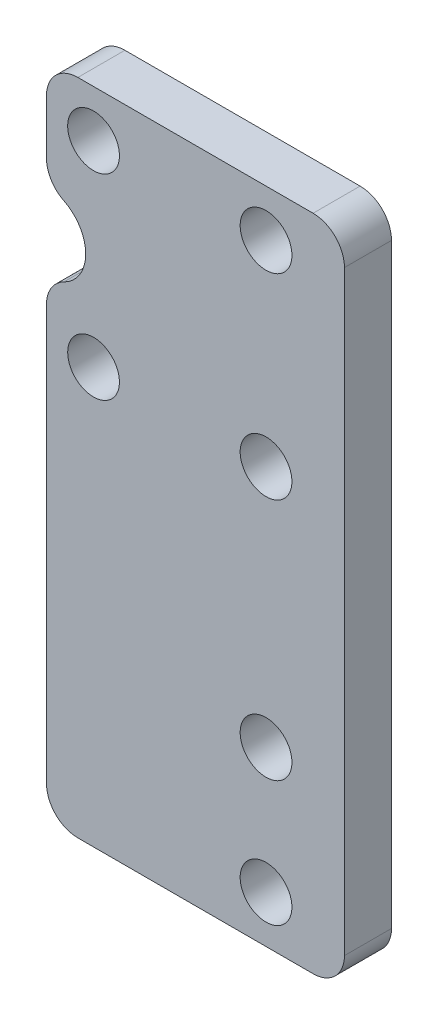
ISO-10303-21;
HEADER;
FILE_DESCRIPTION(('STEP AP214'),'2;1');
FILE_NAME('part.step','',(''),(''),'','','');
FILE_SCHEMA(('AUTOMOTIVE_DESIGN { 1 0 10303 214 1 1 1 1 }'));
ENDSEC;
DATA;
#1=APPLICATION_CONTEXT('core data for automotive mechanical design processes');
#2=APPLICATION_PROTOCOL_DEFINITION('international standard','automotive_design',2000,#1);
#3=PRODUCT_CONTEXT('',#1,'mechanical');
#4=PRODUCT('Part','Part','',(#3));
#5=PRODUCT_RELATED_PRODUCT_CATEGORY('part','',(#4));
#6=PRODUCT_DEFINITION_FORMATION('','',#4);
#7=PRODUCT_DEFINITION_CONTEXT('part definition',#1,'design');
#8=PRODUCT_DEFINITION('design','',#6,#7);
#9=PRODUCT_DEFINITION_SHAPE('','',#8);
#10=(LENGTH_UNIT() NAMED_UNIT(*) SI_UNIT(.MILLI.,.METRE.));
#11=(NAMED_UNIT(*) PLANE_ANGLE_UNIT() SI_UNIT($,.RADIAN.));
#12=(NAMED_UNIT(*) SI_UNIT($,.STERADIAN.) SOLID_ANGLE_UNIT());
#13=UNCERTAINTY_MEASURE_WITH_UNIT(LENGTH_MEASURE(1.E-05),#10,'distance_accuracy_value','');
#14=(GEOMETRIC_REPRESENTATION_CONTEXT(3) GLOBAL_UNCERTAINTY_ASSIGNED_CONTEXT((#13)) GLOBAL_UNIT_ASSIGNED_CONTEXT((#10,
#11,#12)) REPRESENTATION_CONTEXT('',''));
#15=CARTESIAN_POINT('',(0.,0.,0.));
#16=DIRECTION('',(0.,0.,1.));
#17=DIRECTION('',(1.,0.,0.));
#18=AXIS2_PLACEMENT_3D('',#15,#16,#17);
#19=CARTESIAN_POINT('',(-9.5,21.,3.));
#20=DIRECTION('',(1.,0.,0.));
#21=DIRECTION('',(0.,1.,0.));
#22=AXIS2_PLACEMENT_3D('',#19,#20,#21);
#23=PLANE('',#22);
#24=DIRECTION('',(0.,-1.,0.));
#25=VECTOR('',#24,1.);
#26=CARTESIAN_POINT('',(-9.5,21.,3.));
#27=LINE('',#26,#25);
#28=CARTESIAN_POINT('',(-9.5,19.,3.));
#29=VERTEX_POINT('',#28);
#30=CARTESIAN_POINT('',(-9.5,15.5311288741493,3.));
#31=VERTEX_POINT('',#30);
#32=EDGE_CURVE('E147',#29,#31,#27,.T.);
#33=ORIENTED_EDGE('',*,*,#32,.F.);
#34=DIRECTION('',(0.,0.,-1.));
#35=VECTOR('',#34,1.);
#36=CARTESIAN_POINT('',(-9.5,19.,3.));
#37=LINE('',#36,#35);
#38=CARTESIAN_POINT('',(-9.5,19.,0.));
#39=VERTEX_POINT('',#38);
#40=EDGE_CURVE('E170',#29,#39,#37,.T.);
#41=ORIENTED_EDGE('',*,*,#40,.T.);
#42=DIRECTION('',(0.,-1.,0.));
#43=VECTOR('',#42,1.);
#44=CARTESIAN_POINT('',(-9.5,21.,0.));
#45=LINE('',#44,#43);
#46=CARTESIAN_POINT('',(-9.5,15.5311288741493,0.));
#47=VERTEX_POINT('',#46);
#48=EDGE_CURVE('E227',#39,#47,#45,.T.);
#49=ORIENTED_EDGE('',*,*,#48,.T.);
#50=DIRECTION('',(0.,0.,1.));
#51=VECTOR('',#50,1.);
#52=CARTESIAN_POINT('',(-9.5,15.5311288741493,3.));
#53=LINE('',#52,#51);
#54=EDGE_CURVE('E137',#47,#31,#53,.T.);
#55=ORIENTED_EDGE('',*,*,#54,.T.);
#56=EDGE_LOOP('',(#33,#41,#49,#55));
#57=FACE_BOUND('',#56,.T.);
#58=ADVANCED_FACE('F35',(#57),#23,.F.);
#59=CARTESIAN_POINT('',(0.,0.,3.));
#60=DIRECTION('',(0.,0.,1.));
#61=DIRECTION('',(1.,0.,0.));
#62=AXIS2_PLACEMENT_3D('',#59,#60,#61);
#63=PLANE('',#62);
#64=DIRECTION('',(-1.,0.,0.));
#65=VECTOR('',#64,1.);
#66=CARTESIAN_POINT('',(-9.5,21.,3.));
#67=LINE('',#66,#65);
#68=CARTESIAN_POINT('',(7.5,21.,3.));
#69=VERTEX_POINT('',#68);
#70=CARTESIAN_POINT('',(-7.5,21.,3.));
#71=VERTEX_POINT('',#70);
#72=EDGE_CURVE('E148',#69,#71,#67,.T.);
#73=ORIENTED_EDGE('',*,*,#72,.T.);
#74=CARTESIAN_POINT('',(-7.5,19.,3.));
#75=DIRECTION('',(0.,0.,1.));
#76=DIRECTION('',(1.,0.,0.));
#77=AXIS2_PLACEMENT_3D('',#74,#75,#76);
#78=CIRCLE('',#77,2.);
#79=EDGE_CURVE('E191',#71,#29,#78,.T.);
#80=ORIENTED_EDGE('',*,*,#79,.T.);
#81=ORIENTED_EDGE('',*,*,#32,.T.);
#82=CARTESIAN_POINT('',(-7.5,15.5311288741493,3.));
#83=DIRECTION('',(0.,0.,1.));
#84=DIRECTION('',(1.,0.,0.));
#85=AXIS2_PLACEMENT_3D('',#82,#83,#84);
#86=CIRCLE('',#85,2.);
#87=CARTESIAN_POINT('',(-8.38888888888889,13.739516041194,3.));
#88=VERTEX_POINT('',#87);
#89=EDGE_CURVE('E138',#31,#88,#86,.T.);
#90=ORIENTED_EDGE('',*,*,#89,.T.);
#91=CARTESIAN_POINT('',(-9.5,11.5,3.));
#92=DIRECTION('',(0.,0.,1.));
#93=DIRECTION('',(1.,0.,0.));
#94=AXIS2_PLACEMENT_3D('',#91,#92,#93);
#95=CIRCLE('',#94,2.5);
#96=CARTESIAN_POINT('',(-8.38888888888889,9.26048395880596,3.));
#97=VERTEX_POINT('',#96);
#98=EDGE_CURVE('E133',#97,#88,#95,.T.);
#99=ORIENTED_EDGE('',*,*,#98,.F.);
#100=CARTESIAN_POINT('',(-7.5,7.46887112585073,3.));
#101=DIRECTION('',(0.,0.,1.));
#102=DIRECTION('',(1.,0.,0.));
#103=AXIS2_PLACEMENT_3D('',#100,#101,#102);
#104=CIRCLE('',#103,2.);
#105=CARTESIAN_POINT('',(-9.5,7.46887112585073,3.));
#106=VERTEX_POINT('',#105);
#107=EDGE_CURVE('E125',#97,#106,#104,.T.);
#108=ORIENTED_EDGE('',*,*,#107,.T.);
#109=CARTESIAN_POINT('',(-9.5,-19.,3.));
#110=VERTEX_POINT('',#109);
#111=EDGE_CURVE('E130',#106,#110,#27,.T.);
#112=ORIENTED_EDGE('',*,*,#111,.T.);
#113=CARTESIAN_POINT('',(-7.5,-19.,3.));
#114=DIRECTION('',(0.,0.,1.));
#115=DIRECTION('',(1.,0.,0.));
#116=AXIS2_PLACEMENT_3D('',#113,#114,#115);
#117=CIRCLE('',#116,2.);
#118=CARTESIAN_POINT('',(-7.5,-21.,3.));
#119=VERTEX_POINT('',#118);
#120=EDGE_CURVE('E186',#110,#119,#117,.T.);
#121=ORIENTED_EDGE('',*,*,#120,.T.);
#122=DIRECTION('',(1.,0.,0.));
#123=VECTOR('',#122,1.);
#124=CARTESIAN_POINT('',(-9.5,-21.,3.));
#125=LINE('',#124,#123);
#126=CARTESIAN_POINT('',(7.5,-21.,3.));
#127=VERTEX_POINT('',#126);
#128=EDGE_CURVE('E153',#119,#127,#125,.T.);
#129=ORIENTED_EDGE('',*,*,#128,.T.);
#130=CARTESIAN_POINT('',(7.5,-19.,3.));
#131=DIRECTION('',(0.,0.,1.));
#132=DIRECTION('',(1.,0.,0.));
#133=AXIS2_PLACEMENT_3D('',#130,#131,#132);
#134=CIRCLE('',#133,2.);
#135=CARTESIAN_POINT('',(9.5,-19.,3.));
#136=VERTEX_POINT('',#135);
#137=EDGE_CURVE('E57',#127,#136,#134,.T.);
#138=ORIENTED_EDGE('',*,*,#137,.T.);
#139=DIRECTION('',(0.,1.,0.));
#140=VECTOR('',#139,1.);
#141=CARTESIAN_POINT('',(9.5,21.,3.));
#142=LINE('',#141,#140);
#143=CARTESIAN_POINT('',(9.5,19.,3.));
#144=VERTEX_POINT('',#143);
#145=EDGE_CURVE('E212',#136,#144,#142,.T.);
#146=ORIENTED_EDGE('',*,*,#145,.T.);
#147=CARTESIAN_POINT('',(7.5,19.,3.));
#148=DIRECTION('',(0.,0.,1.));
#149=DIRECTION('',(1.,0.,0.));
#150=AXIS2_PLACEMENT_3D('',#147,#148,#149);
#151=CIRCLE('',#150,2.);
#152=EDGE_CURVE('E189',#144,#69,#151,.T.);
#153=ORIENTED_EDGE('',*,*,#152,.T.);
#154=EDGE_LOOP('',(#73,#80,#81,#90,#99,#108,#112,#121,#129,#138,#146,#153));
#155=FACE_BOUND('',#154,.T.);
#156=CARTESIAN_POINT('',(4.5,18.,3.));
#157=DIRECTION('',(0.,0.,1.));
#158=DIRECTION('',(1.,0.,0.));
#159=AXIS2_PLACEMENT_3D('',#156,#157,#158);
#160=CIRCLE('',#159,1.65);
#161=CARTESIAN_POINT('',(6.15,18.,3.));
#162=VERTEX_POINT('',#161);
#163=EDGE_CURVE('E299',#162,#162,#160,.T.);
#164=ORIENTED_EDGE('',*,*,#163,.F.);
#165=EDGE_LOOP('',(#164));
#166=FACE_BOUND('',#165,.T.);
#167=CARTESIAN_POINT('',(4.5,-9.99999999999999,3.));
#168=DIRECTION('',(0.,0.,1.));
#169=DIRECTION('',(1.,0.,0.));
#170=AXIS2_PLACEMENT_3D('',#167,#168,#169);
#171=CIRCLE('',#170,1.65);
#172=CARTESIAN_POINT('',(6.15,-9.99999999999999,3.));
#173=VERTEX_POINT('',#172);
#174=EDGE_CURVE('E311',#173,#173,#171,.T.);
#175=ORIENTED_EDGE('',*,*,#174,.F.);
#176=EDGE_LOOP('',(#175));
#177=FACE_BOUND('',#176,.T.);
#178=CARTESIAN_POINT('',(-6.5,18.,3.));
#179=DIRECTION('',(0.,0.,1.));
#180=DIRECTION('',(1.,0.,0.));
#181=AXIS2_PLACEMENT_3D('',#178,#179,#180);
#182=CIRCLE('',#181,1.65);
#183=CARTESIAN_POINT('',(-4.85,18.,3.));
#184=VERTEX_POINT('',#183);
#185=EDGE_CURVE('E219',#184,#184,#182,.T.);
#186=ORIENTED_EDGE('',*,*,#185,.F.);
#187=EDGE_LOOP('',(#186));
#188=FACE_BOUND('',#187,.T.);
#189=CARTESIAN_POINT('',(-6.5,5.50000000000001,3.));
#190=DIRECTION('',(0.,0.,1.));
#191=DIRECTION('',(-1.,0.,0.));
#192=AXIS2_PLACEMENT_3D('',#189,#190,#191);
#193=CIRCLE('',#192,1.65);
#194=CARTESIAN_POINT('',(-8.15,5.50000000000001,3.));
#195=VERTEX_POINT('',#194);
#196=EDGE_CURVE('E317',#195,#195,#193,.T.);
#197=ORIENTED_EDGE('',*,*,#196,.F.);
#198=EDGE_LOOP('',(#197));
#199=FACE_BOUND('',#198,.T.);
#200=CARTESIAN_POINT('',(4.5,-18.,3.));
#201=DIRECTION('',(0.,0.,1.));
#202=DIRECTION('',(1.,0.,0.));
#203=AXIS2_PLACEMENT_3D('',#200,#201,#202);
#204=CIRCLE('',#203,1.65000000000001);
#205=CARTESIAN_POINT('',(6.15000000000001,-18.,3.));
#206=VERTEX_POINT('',#205);
#207=EDGE_CURVE('E305',#206,#206,#204,.T.);
#208=ORIENTED_EDGE('',*,*,#207,.F.);
#209=EDGE_LOOP('',(#208));
#210=FACE_BOUND('',#209,.T.);
#211=CARTESIAN_POINT('',(4.5,5.50000000000001,3.));
#212=DIRECTION('',(0.,0.,1.));
#213=DIRECTION('',(1.,0.,0.));
#214=AXIS2_PLACEMENT_3D('',#211,#212,#213);
#215=CIRCLE('',#214,1.65);
#216=CARTESIAN_POINT('',(6.15,5.50000000000001,3.));
#217=VERTEX_POINT('',#216);
#218=EDGE_CURVE('E292',#217,#217,#215,.T.);
#219=ORIENTED_EDGE('',*,*,#218,.F.);
#220=EDGE_LOOP('',(#219));
#221=FACE_BOUND('',#220,.T.);
#222=ADVANCED_FACE('F128',(#155,#166,#177,#188,#199,#210,#221),#63,.T.);
#223=CARTESIAN_POINT('',(0.,0.,0.));
#224=DIRECTION('',(0.,0.,1.));
#225=DIRECTION('',(1.,0.,0.));
#226=AXIS2_PLACEMENT_3D('',#223,#224,#225);
#227=PLANE('',#226);
#228=ORIENTED_EDGE('',*,*,#48,.F.);
#229=CARTESIAN_POINT('',(-7.5,19.,0.));
#230=DIRECTION('',(0.,0.,1.));
#231=DIRECTION('',(1.,0.,0.));
#232=AXIS2_PLACEMENT_3D('',#229,#230,#231);
#233=CIRCLE('',#232,2.);
#234=CARTESIAN_POINT('',(-7.5,21.,0.));
#235=VERTEX_POINT('',#234);
#236=EDGE_CURVE('E179',#39,#235,#233,.F.);
#237=ORIENTED_EDGE('',*,*,#236,.T.);
#238=DIRECTION('',(-1.,0.,0.));
#239=VECTOR('',#238,1.);
#240=CARTESIAN_POINT('',(-9.5,21.,0.));
#241=LINE('',#240,#239);
#242=CARTESIAN_POINT('',(7.5,21.,0.));
#243=VERTEX_POINT('',#242);
#244=EDGE_CURVE('E218',#243,#235,#241,.T.);
#245=ORIENTED_EDGE('',*,*,#244,.F.);
#246=CARTESIAN_POINT('',(7.5,19.,0.));
#247=DIRECTION('',(0.,0.,1.));
#248=DIRECTION('',(1.,0.,0.));
#249=AXIS2_PLACEMENT_3D('',#246,#247,#248);
#250=CIRCLE('',#249,2.);
#251=CARTESIAN_POINT('',(9.5,19.,0.));
#252=VERTEX_POINT('',#251);
#253=EDGE_CURVE('E177',#243,#252,#250,.F.);
#254=ORIENTED_EDGE('',*,*,#253,.T.);
#255=DIRECTION('',(0.,1.,0.));
#256=VECTOR('',#255,1.);
#257=CARTESIAN_POINT('',(9.5,21.,0.));
#258=LINE('',#257,#256);
#259=CARTESIAN_POINT('',(9.5,-19.,0.));
#260=VERTEX_POINT('',#259);
#261=EDGE_CURVE('E211',#260,#252,#258,.T.);
#262=ORIENTED_EDGE('',*,*,#261,.F.);
#263=CARTESIAN_POINT('',(7.5,-19.,0.));
#264=DIRECTION('',(0.,0.,1.));
#265=DIRECTION('',(1.,0.,0.));
#266=AXIS2_PLACEMENT_3D('',#263,#264,#265);
#267=CIRCLE('',#266,2.);
#268=CARTESIAN_POINT('',(7.5,-21.,0.));
#269=VERTEX_POINT('',#268);
#270=EDGE_CURVE('E175',#260,#269,#267,.F.);
#271=ORIENTED_EDGE('',*,*,#270,.T.);
#272=DIRECTION('',(1.,0.,0.));
#273=VECTOR('',#272,1.);
#274=CARTESIAN_POINT('',(-9.5,-21.,0.));
#275=LINE('',#274,#273);
#276=CARTESIAN_POINT('',(-7.5,-21.,0.));
#277=VERTEX_POINT('',#276);
#278=EDGE_CURVE('E159',#277,#269,#275,.T.);
#279=ORIENTED_EDGE('',*,*,#278,.F.);
#280=CARTESIAN_POINT('',(-7.5,-19.,0.));
#281=DIRECTION('',(0.,0.,1.));
#282=DIRECTION('',(1.,0.,0.));
#283=AXIS2_PLACEMENT_3D('',#280,#281,#282);
#284=CIRCLE('',#283,2.);
#285=CARTESIAN_POINT('',(-9.5,-19.,0.));
#286=VERTEX_POINT('',#285);
#287=EDGE_CURVE('E173',#277,#286,#284,.F.);
#288=ORIENTED_EDGE('',*,*,#287,.T.);
#289=CARTESIAN_POINT('',(-9.5,7.46887112585073,0.));
#290=VERTEX_POINT('',#289);
#291=EDGE_CURVE('E222',#290,#286,#45,.T.);
#292=ORIENTED_EDGE('',*,*,#291,.F.);
#293=CARTESIAN_POINT('',(-7.5,7.46887112585073,0.));
#294=DIRECTION('',(0.,0.,1.));
#295=DIRECTION('',(1.,0.,0.));
#296=AXIS2_PLACEMENT_3D('',#293,#294,#295);
#297=CIRCLE('',#296,2.);
#298=CARTESIAN_POINT('',(-8.38888888888889,9.26048395880596,0.));
#299=VERTEX_POINT('',#298);
#300=EDGE_CURVE('E151',#290,#299,#297,.F.);
#301=ORIENTED_EDGE('',*,*,#300,.T.);
#302=CARTESIAN_POINT('',(-9.5,11.5,0.));
#303=DIRECTION('',(0.,0.,1.));
#304=DIRECTION('',(1.,0.,0.));
#305=AXIS2_PLACEMENT_3D('',#302,#303,#304);
#306=CIRCLE('',#305,2.5);
#307=CARTESIAN_POINT('',(-8.38888888888889,13.739516041194,0.));
#308=VERTEX_POINT('',#307);
#309=EDGE_CURVE('E288',#299,#308,#306,.T.);
#310=ORIENTED_EDGE('',*,*,#309,.T.);
#311=CARTESIAN_POINT('',(-7.5,15.5311288741493,0.));
#312=DIRECTION('',(0.,0.,1.));
#313=DIRECTION('',(1.,0.,0.));
#314=AXIS2_PLACEMENT_3D('',#311,#312,#313);
#315=CIRCLE('',#314,2.);
#316=EDGE_CURVE('E152',#308,#47,#315,.F.);
#317=ORIENTED_EDGE('',*,*,#316,.T.);
#318=EDGE_LOOP('',(#228,#237,#245,#254,#262,#271,#279,#288,#292,#301,#310,#317));
#319=FACE_BOUND('',#318,.T.);
#320=CARTESIAN_POINT('',(-6.5,18.,0.));
#321=DIRECTION('',(0.,0.,1.));
#322=DIRECTION('',(1.,0.,0.));
#323=AXIS2_PLACEMENT_3D('',#320,#321,#322);
#324=CIRCLE('',#323,1.65);
#325=CARTESIAN_POINT('',(-4.85,18.,0.));
#326=VERTEX_POINT('',#325);
#327=EDGE_CURVE('E225',#326,#326,#324,.T.);
#328=ORIENTED_EDGE('',*,*,#327,.T.);
#329=EDGE_LOOP('',(#328));
#330=FACE_BOUND('',#329,.T.);
#331=CARTESIAN_POINT('',(-6.5,5.50000000000001,0.));
#332=DIRECTION('',(0.,0.,1.));
#333=DIRECTION('',(-1.,0.,0.));
#334=AXIS2_PLACEMENT_3D('',#331,#332,#333);
#335=CIRCLE('',#334,1.65);
#336=CARTESIAN_POINT('',(-8.15,5.50000000000001,0.));
#337=VERTEX_POINT('',#336);
#338=EDGE_CURVE('E314',#337,#337,#335,.T.);
#339=ORIENTED_EDGE('',*,*,#338,.T.);
#340=EDGE_LOOP('',(#339));
#341=FACE_BOUND('',#340,.T.);
#342=CARTESIAN_POINT('',(4.5,-9.99999999999999,0.));
#343=DIRECTION('',(0.,0.,1.));
#344=DIRECTION('',(1.,0.,0.));
#345=AXIS2_PLACEMENT_3D('',#342,#343,#344);
#346=CIRCLE('',#345,1.65);
#347=CARTESIAN_POINT('',(6.15,-9.99999999999999,0.));
#348=VERTEX_POINT('',#347);
#349=EDGE_CURVE('E308',#348,#348,#346,.T.);
#350=ORIENTED_EDGE('',*,*,#349,.T.);
#351=EDGE_LOOP('',(#350));
#352=FACE_BOUND('',#351,.T.);
#353=CARTESIAN_POINT('',(4.5,-18.,0.));
#354=DIRECTION('',(0.,0.,1.));
#355=DIRECTION('',(1.,0.,0.));
#356=AXIS2_PLACEMENT_3D('',#353,#354,#355);
#357=CIRCLE('',#356,1.65000000000001);
#358=CARTESIAN_POINT('',(6.15000000000001,-18.,0.));
#359=VERTEX_POINT('',#358);
#360=EDGE_CURVE('E302',#359,#359,#357,.T.);
#361=ORIENTED_EDGE('',*,*,#360,.T.);
#362=EDGE_LOOP('',(#361));
#363=FACE_BOUND('',#362,.T.);
#364=CARTESIAN_POINT('',(4.5,18.,0.));
#365=DIRECTION('',(0.,0.,1.));
#366=DIRECTION('',(1.,0.,0.));
#367=AXIS2_PLACEMENT_3D('',#364,#365,#366);
#368=CIRCLE('',#367,1.65);
#369=CARTESIAN_POINT('',(6.15,18.,0.));
#370=VERTEX_POINT('',#369);
#371=EDGE_CURVE('E297',#370,#370,#368,.T.);
#372=ORIENTED_EDGE('',*,*,#371,.T.);
#373=EDGE_LOOP('',(#372));
#374=FACE_BOUND('',#373,.T.);
#375=CARTESIAN_POINT('',(4.5,5.50000000000001,0.));
#376=DIRECTION('',(0.,0.,1.));
#377=DIRECTION('',(1.,0.,0.));
#378=AXIS2_PLACEMENT_3D('',#375,#376,#377);
#379=CIRCLE('',#378,1.65);
#380=CARTESIAN_POINT('',(6.15,5.50000000000001,0.));
#381=VERTEX_POINT('',#380);
#382=EDGE_CURVE('E289',#381,#381,#379,.T.);
#383=ORIENTED_EDGE('',*,*,#382,.T.);
#384=EDGE_LOOP('',(#383));
#385=FACE_BOUND('',#384,.T.);
#386=ADVANCED_FACE('F215',(#319,#330,#341,#352,#363,#374,#385),#227,.F.);
#387=CARTESIAN_POINT('',(9.5,21.,3.));
#388=DIRECTION('',(-1.,0.,0.));
#389=DIRECTION('',(0.,-1.,0.));
#390=AXIS2_PLACEMENT_3D('',#387,#388,#389);
#391=PLANE('',#390);
#392=ORIENTED_EDGE('',*,*,#261,.T.);
#393=DIRECTION('',(0.,0.,-1.));
#394=VECTOR('',#393,1.);
#395=CARTESIAN_POINT('',(9.5,19.,3.));
#396=LINE('',#395,#394);
#397=EDGE_CURVE('E50',#252,#144,#396,.F.);
#398=ORIENTED_EDGE('',*,*,#397,.T.);
#399=ORIENTED_EDGE('',*,*,#145,.F.);
#400=DIRECTION('',(0.,0.,-1.));
#401=VECTOR('',#400,1.);
#402=CARTESIAN_POINT('',(9.5,-19.,3.));
#403=LINE('',#402,#401);
#404=EDGE_CURVE('E193',#136,#260,#403,.T.);
#405=ORIENTED_EDGE('',*,*,#404,.T.);
#406=EDGE_LOOP('',(#392,#398,#399,#405));
#407=FACE_BOUND('',#406,.T.);
#408=ADVANCED_FACE('F210',(#407),#391,.F.);
#409=CARTESIAN_POINT('',(-9.5,21.,3.));
#410=DIRECTION('',(0.,-1.,0.));
#411=DIRECTION('',(0.,0.,-1.));
#412=AXIS2_PLACEMENT_3D('',#409,#410,#411);
#413=PLANE('',#412);
#414=ORIENTED_EDGE('',*,*,#244,.T.);
#415=DIRECTION('',(0.,0.,-1.));
#416=VECTOR('',#415,1.);
#417=CARTESIAN_POINT('',(-7.5,21.,3.));
#418=LINE('',#417,#416);
#419=EDGE_CURVE('E184',#235,#71,#418,.F.);
#420=ORIENTED_EDGE('',*,*,#419,.T.);
#421=ORIENTED_EDGE('',*,*,#72,.F.);
#422=DIRECTION('',(0.,0.,-1.));
#423=VECTOR('',#422,1.);
#424=CARTESIAN_POINT('',(7.5,21.,3.));
#425=LINE('',#424,#423);
#426=EDGE_CURVE('E181',#69,#243,#425,.T.);
#427=ORIENTED_EDGE('',*,*,#426,.T.);
#428=EDGE_LOOP('',(#414,#420,#421,#427));
#429=FACE_BOUND('',#428,.T.);
#430=ADVANCED_FACE('F245',(#429),#413,.F.);
#431=ORIENTED_EDGE('',*,*,#291,.T.);
#432=DIRECTION('',(0.,0.,-1.));
#433=VECTOR('',#432,1.);
#434=CARTESIAN_POINT('',(-9.5,-19.,3.));
#435=LINE('',#434,#433);
#436=EDGE_CURVE('E11',#286,#110,#435,.F.);
#437=ORIENTED_EDGE('',*,*,#436,.T.);
#438=ORIENTED_EDGE('',*,*,#111,.F.);
#439=DIRECTION('',(0.,0.,1.));
#440=VECTOR('',#439,1.);
#441=CARTESIAN_POINT('',(-9.5,7.46887112585073,3.));
#442=LINE('',#441,#440);
#443=EDGE_CURVE('E144',#106,#290,#442,.F.);
#444=ORIENTED_EDGE('',*,*,#443,.T.);
#445=EDGE_LOOP('',(#431,#437,#438,#444));
#446=FACE_BOUND('',#445,.T.);
#447=ADVANCED_FACE('F143',(#446),#23,.F.);
#448=CARTESIAN_POINT('',(-9.5,-21.,3.));
#449=DIRECTION('',(0.,1.,0.));
#450=DIRECTION('',(0.,0.,1.));
#451=AXIS2_PLACEMENT_3D('',#448,#449,#450);
#452=PLANE('',#451);
#453=ORIENTED_EDGE('',*,*,#278,.T.);
#454=DIRECTION('',(0.,0.,-1.));
#455=VECTOR('',#454,1.);
#456=CARTESIAN_POINT('',(7.5,-21.,3.));
#457=LINE('',#456,#455);
#458=EDGE_CURVE('E43',#269,#127,#457,.F.);
#459=ORIENTED_EDGE('',*,*,#458,.T.);
#460=ORIENTED_EDGE('',*,*,#128,.F.);
#461=DIRECTION('',(0.,0.,-1.));
#462=VECTOR('',#461,1.);
#463=CARTESIAN_POINT('',(-7.5,-21.,3.));
#464=LINE('',#463,#462);
#465=EDGE_CURVE('E197',#119,#277,#464,.T.);
#466=ORIENTED_EDGE('',*,*,#465,.T.);
#467=EDGE_LOOP('',(#453,#459,#460,#466));
#468=FACE_BOUND('',#467,.T.);
#469=ADVANCED_FACE('F203',(#468),#452,.F.);
#470=CARTESIAN_POINT('',(-6.5,18.,3.));
#471=DIRECTION('',(0.,0.,-1.));
#472=DIRECTION('',(-1.,0.,0.));
#473=AXIS2_PLACEMENT_3D('',#470,#471,#472);
#474=CYLINDRICAL_SURFACE('',#473,1.65);
#475=ORIENTED_EDGE('',*,*,#185,.T.);
#476=EDGE_LOOP('',(#475));
#477=FACE_BOUND('',#476,.T.);
#478=ORIENTED_EDGE('',*,*,#327,.F.);
#479=EDGE_LOOP('',(#478));
#480=FACE_BOUND('',#479,.T.);
#481=ADVANCED_FACE('F250',(#477,#480),#474,.F.);
#482=CARTESIAN_POINT('',(-6.5,5.50000000000001,3.));
#483=DIRECTION('',(0.,0.,-1.));
#484=DIRECTION('',(-1.,0.,0.));
#485=AXIS2_PLACEMENT_3D('',#482,#483,#484);
#486=CYLINDRICAL_SURFACE('',#485,1.65);
#487=ORIENTED_EDGE('',*,*,#196,.T.);
#488=EDGE_LOOP('',(#487));
#489=FACE_BOUND('',#488,.T.);
#490=ORIENTED_EDGE('',*,*,#338,.F.);
#491=EDGE_LOOP('',(#490));
#492=FACE_BOUND('',#491,.T.);
#493=ADVANCED_FACE('F326',(#489,#492),#486,.F.);
#494=CARTESIAN_POINT('',(4.5,-9.99999999999999,3.));
#495=DIRECTION('',(0.,0.,-1.));
#496=DIRECTION('',(-1.,0.,0.));
#497=AXIS2_PLACEMENT_3D('',#494,#495,#496);
#498=CYLINDRICAL_SURFACE('',#497,1.65);
#499=ORIENTED_EDGE('',*,*,#174,.T.);
#500=EDGE_LOOP('',(#499));
#501=FACE_BOUND('',#500,.T.);
#502=ORIENTED_EDGE('',*,*,#349,.F.);
#503=EDGE_LOOP('',(#502));
#504=FACE_BOUND('',#503,.T.);
#505=ADVANCED_FACE('F332',(#501,#504),#498,.F.);
#506=CARTESIAN_POINT('',(4.5,-18.,3.));
#507=DIRECTION('',(0.,0.,-1.));
#508=DIRECTION('',(-1.,0.,0.));
#509=AXIS2_PLACEMENT_3D('',#506,#507,#508);
#510=CYLINDRICAL_SURFACE('',#509,1.65000000000001);
#511=ORIENTED_EDGE('',*,*,#207,.T.);
#512=EDGE_LOOP('',(#511));
#513=FACE_BOUND('',#512,.T.);
#514=ORIENTED_EDGE('',*,*,#360,.F.);
#515=EDGE_LOOP('',(#514));
#516=FACE_BOUND('',#515,.T.);
#517=ADVANCED_FACE('F412',(#513,#516),#510,.F.);
#518=CARTESIAN_POINT('',(4.5,18.,3.));
#519=DIRECTION('',(0.,0.,-1.));
#520=DIRECTION('',(-1.,0.,0.));
#521=AXIS2_PLACEMENT_3D('',#518,#519,#520);
#522=CYLINDRICAL_SURFACE('',#521,1.65);
#523=ORIENTED_EDGE('',*,*,#163,.T.);
#524=EDGE_LOOP('',(#523));
#525=FACE_BOUND('',#524,.T.);
#526=ORIENTED_EDGE('',*,*,#371,.F.);
#527=EDGE_LOOP('',(#526));
#528=FACE_BOUND('',#527,.T.);
#529=ADVANCED_FACE('F404',(#525,#528),#522,.F.);
#530=CARTESIAN_POINT('',(4.5,5.50000000000001,3.));
#531=DIRECTION('',(0.,0.,-1.));
#532=DIRECTION('',(-1.,0.,0.));
#533=AXIS2_PLACEMENT_3D('',#530,#531,#532);
#534=CYLINDRICAL_SURFACE('',#533,1.65);
#535=ORIENTED_EDGE('',*,*,#218,.T.);
#536=EDGE_LOOP('',(#535));
#537=FACE_BOUND('',#536,.T.);
#538=ORIENTED_EDGE('',*,*,#382,.F.);
#539=EDGE_LOOP('',(#538));
#540=FACE_BOUND('',#539,.T.);
#541=ADVANCED_FACE('F397',(#537,#540),#534,.F.);
#542=CARTESIAN_POINT('',(-9.5,11.5,0.));
#543=DIRECTION('',(0.,0.,1.));
#544=DIRECTION('',(1.,0.,0.));
#545=AXIS2_PLACEMENT_3D('',#542,#543,#544);
#546=CYLINDRICAL_SURFACE('',#545,2.5);
#547=ORIENTED_EDGE('',*,*,#309,.F.);
#548=DIRECTION('',(0.,0.,1.));
#549=VECTOR('',#548,1.);
#550=CARTESIAN_POINT('',(-8.38888888888889,9.26048395880596,0.));
#551=LINE('',#550,#549);
#552=EDGE_CURVE('E165',#299,#97,#551,.T.);
#553=ORIENTED_EDGE('',*,*,#552,.T.);
#554=ORIENTED_EDGE('',*,*,#98,.T.);
#555=DIRECTION('',(0.,0.,1.));
#556=VECTOR('',#555,1.);
#557=CARTESIAN_POINT('',(-8.38888888888889,13.739516041194,0.));
#558=LINE('',#557,#556);
#559=EDGE_CURVE('E163',#88,#308,#558,.F.);
#560=ORIENTED_EDGE('',*,*,#559,.T.);
#561=EDGE_LOOP('',(#547,#553,#554,#560));
#562=FACE_BOUND('',#561,.T.);
#563=ADVANCED_FACE('F260',(#562),#546,.F.);
#564=CARTESIAN_POINT('',(-7.5,7.46887112585073,0.));
#565=DIRECTION('',(0.,0.,1.));
#566=DIRECTION('',(1.,0.,0.));
#567=AXIS2_PLACEMENT_3D('',#564,#565,#566);
#568=CYLINDRICAL_SURFACE('',#567,2.);
#569=ORIENTED_EDGE('',*,*,#107,.F.);
#570=ORIENTED_EDGE('',*,*,#552,.F.);
#571=ORIENTED_EDGE('',*,*,#300,.F.);
#572=ORIENTED_EDGE('',*,*,#443,.F.);
#573=EDGE_LOOP('',(#569,#570,#571,#572));
#574=FACE_BOUND('',#573,.T.);
#575=ADVANCED_FACE('F150',(#574),#568,.T.);
#576=CARTESIAN_POINT('',(-7.5,15.5311288741493,0.));
#577=DIRECTION('',(0.,0.,1.));
#578=DIRECTION('',(1.,0.,0.));
#579=AXIS2_PLACEMENT_3D('',#576,#577,#578);
#580=CYLINDRICAL_SURFACE('',#579,2.);
#581=ORIENTED_EDGE('',*,*,#316,.F.);
#582=ORIENTED_EDGE('',*,*,#559,.F.);
#583=ORIENTED_EDGE('',*,*,#89,.F.);
#584=ORIENTED_EDGE('',*,*,#54,.F.);
#585=EDGE_LOOP('',(#581,#582,#583,#584));
#586=FACE_BOUND('',#585,.T.);
#587=ADVANCED_FACE('F259',(#586),#580,.T.);
#588=CARTESIAN_POINT('',(-7.5,19.,3.));
#589=DIRECTION('',(0.,0.,-1.));
#590=DIRECTION('',(-1.,0.,0.));
#591=AXIS2_PLACEMENT_3D('',#588,#589,#590);
#592=CYLINDRICAL_SURFACE('',#591,2.);
#593=ORIENTED_EDGE('',*,*,#79,.F.);
#594=ORIENTED_EDGE('',*,*,#419,.F.);
#595=ORIENTED_EDGE('',*,*,#236,.F.);
#596=ORIENTED_EDGE('',*,*,#40,.F.);
#597=EDGE_LOOP('',(#593,#594,#595,#596));
#598=FACE_BOUND('',#597,.T.);
#599=ADVANCED_FACE('F263',(#598),#592,.T.);
#600=CARTESIAN_POINT('',(7.5,19.,3.));
#601=DIRECTION('',(0.,0.,-1.));
#602=DIRECTION('',(-1.,0.,0.));
#603=AXIS2_PLACEMENT_3D('',#600,#601,#602);
#604=CYLINDRICAL_SURFACE('',#603,2.);
#605=ORIENTED_EDGE('',*,*,#152,.F.);
#606=ORIENTED_EDGE('',*,*,#397,.F.);
#607=ORIENTED_EDGE('',*,*,#253,.F.);
#608=ORIENTED_EDGE('',*,*,#426,.F.);
#609=EDGE_LOOP('',(#605,#606,#607,#608));
#610=FACE_BOUND('',#609,.T.);
#611=ADVANCED_FACE('F234',(#610),#604,.T.);
#612=CARTESIAN_POINT('',(7.5,-19.,3.));
#613=DIRECTION('',(0.,0.,-1.));
#614=DIRECTION('',(-1.,0.,0.));
#615=AXIS2_PLACEMENT_3D('',#612,#613,#614);
#616=CYLINDRICAL_SURFACE('',#615,2.);
#617=ORIENTED_EDGE('',*,*,#137,.F.);
#618=ORIENTED_EDGE('',*,*,#458,.F.);
#619=ORIENTED_EDGE('',*,*,#270,.F.);
#620=ORIENTED_EDGE('',*,*,#404,.F.);
#621=EDGE_LOOP('',(#617,#618,#619,#620));
#622=FACE_BOUND('',#621,.T.);
#623=ADVANCED_FACE('F208',(#622),#616,.T.);
#624=CARTESIAN_POINT('',(-7.5,-19.,3.));
#625=DIRECTION('',(0.,0.,-1.));
#626=DIRECTION('',(-1.,0.,0.));
#627=AXIS2_PLACEMENT_3D('',#624,#625,#626);
#628=CYLINDRICAL_SURFACE('',#627,2.);
#629=ORIENTED_EDGE('',*,*,#120,.F.);
#630=ORIENTED_EDGE('',*,*,#436,.F.);
#631=ORIENTED_EDGE('',*,*,#287,.F.);
#632=ORIENTED_EDGE('',*,*,#465,.F.);
#633=EDGE_LOOP('',(#629,#630,#631,#632));
#634=FACE_BOUND('',#633,.T.);
#635=ADVANCED_FACE('F37',(#634),#628,.T.);
#636=CLOSED_SHELL('',(#58,#222,#386,#408,#430,#447,#469,#481,#493,#505,#517,#529,#541,#563,#575,
#587,#599,#611,#623,#635));
#637=MANIFOLD_SOLID_BREP('B2',#636);
#638=ADVANCED_BREP_SHAPE_REPRESENTATION('',(#18,#637),#14);
#639=SHAPE_DEFINITION_REPRESENTATION(#9,#638);
ENDSEC;
END-ISO-10303-21;
